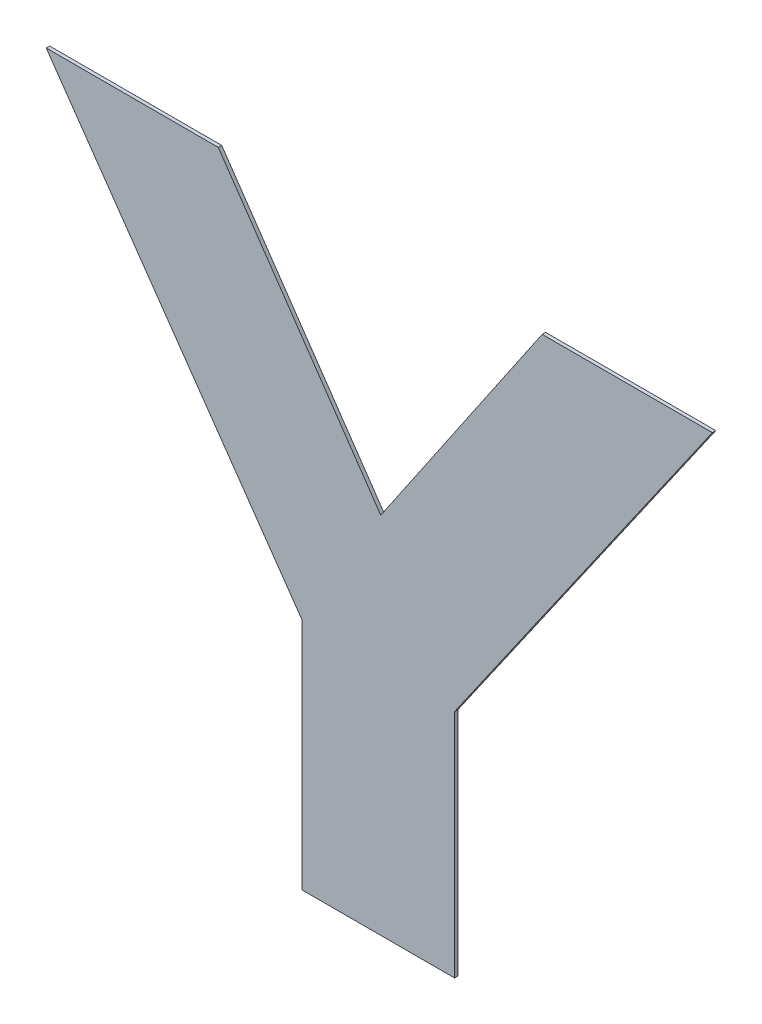
ISO-10303-21;
HEADER;
FILE_DESCRIPTION(('STEP AP214'),'2;1');
FILE_NAME('part.step','',(''),(''),'','','');
FILE_SCHEMA(('AUTOMOTIVE_DESIGN { 1 0 10303 214 1 1 1 1 }'));
ENDSEC;
DATA;
#1=APPLICATION_CONTEXT('core data for automotive mechanical design processes');
#2=APPLICATION_PROTOCOL_DEFINITION('international standard','automotive_design',2000,#1);
#3=PRODUCT_CONTEXT('',#1,'mechanical');
#4=PRODUCT('Part','Part','',(#3));
#5=PRODUCT_RELATED_PRODUCT_CATEGORY('part','',(#4));
#6=PRODUCT_DEFINITION_FORMATION('','',#4);
#7=PRODUCT_DEFINITION_CONTEXT('part definition',#1,'design');
#8=PRODUCT_DEFINITION('design','',#6,#7);
#9=PRODUCT_DEFINITION_SHAPE('','',#8);
#10=(LENGTH_UNIT() NAMED_UNIT(*) SI_UNIT(.MILLI.,.METRE.));
#11=(NAMED_UNIT(*) PLANE_ANGLE_UNIT() SI_UNIT($,.RADIAN.));
#12=(NAMED_UNIT(*) SI_UNIT($,.STERADIAN.) SOLID_ANGLE_UNIT());
#13=UNCERTAINTY_MEASURE_WITH_UNIT(LENGTH_MEASURE(1.E-05),#10,'distance_accuracy_value','');
#14=(GEOMETRIC_REPRESENTATION_CONTEXT(3) GLOBAL_UNCERTAINTY_ASSIGNED_CONTEXT((#13)) GLOBAL_UNIT_ASSIGNED_CONTEXT((#10,
#11,#12)) REPRESENTATION_CONTEXT('',''));
#15=CARTESIAN_POINT('',(0.,0.,0.));
#16=DIRECTION('',(0.,0.,1.));
#17=DIRECTION('',(1.,0.,0.));
#18=AXIS2_PLACEMENT_3D('',#15,#16,#17);
#19=CARTESIAN_POINT('',(0.00426733972599983,0.917937256962008,0.00015));
#20=DIRECTION('',(-0.820629637441726,-0.571460408210631,0.));
#21=DIRECTION('',(0.,0.,1.));
#22=AXIS2_PLACEMENT_3D('',#19,#20,#21);
#23=PLANE('',#22);
#24=DIRECTION('',(0.,0.,1.));
#25=VECTOR('',#24,1.);
#26=CARTESIAN_POINT('',(0.00985104395099982,0.909918935643667,0.));
#27=LINE('',#26,#25);
#28=CARTESIAN_POINT('',(0.00985104395099982,0.909918935643667,0.));
#29=VERTEX_POINT('',#28);
#30=CARTESIAN_POINT('',(0.00985104395099982,0.909918935643667,0.00015));
#31=VERTEX_POINT('',#30);
#32=EDGE_CURVE('E11',#29,#31,#27,.T.);
#33=ORIENTED_EDGE('',*,*,#32,.T.);
#34=DIRECTION('',(-0.571460408210631,0.820629637441726,0.));
#35=VECTOR('',#34,1.);
#36=CARTESIAN_POINT('',(0.00985104395099982,0.909918935643667,0.00015));
#37=LINE('',#36,#35);
#38=CARTESIAN_POINT('',(-0.00131636449900017,0.92595557828035,0.00015));
#39=VERTEX_POINT('',#38);
#40=EDGE_CURVE('E24',#31,#39,#37,.T.);
#41=ORIENTED_EDGE('',*,*,#40,.T.);
#42=DIRECTION('',(0.,0.,1.));
#43=VECTOR('',#42,1.);
#44=CARTESIAN_POINT('',(-0.00131636449900017,0.92595557828035,0.));
#45=LINE('',#44,#43);
#46=CARTESIAN_POINT('',(-0.00131636449900017,0.92595557828035,0.));
#47=VERTEX_POINT('',#46);
#48=EDGE_CURVE('E155',#47,#39,#45,.T.);
#49=ORIENTED_EDGE('',*,*,#48,.F.);
#50=DIRECTION('',(-0.571460408210631,0.820629637441726,0.));
#51=VECTOR('',#50,1.);
#52=CARTESIAN_POINT('',(0.00985104395099982,0.909918935643667,0.));
#53=LINE('',#52,#51);
#54=EDGE_CURVE('E153',#29,#47,#53,.T.);
#55=ORIENTED_EDGE('',*,*,#54,.F.);
#56=EDGE_LOOP('',(#33,#41,#49,#55));
#57=FACE_BOUND('',#56,.T.);
#58=ADVANCED_FACE('F17',(#57),#23,.T.);
#59=CARTESIAN_POINT('',(0.00244222272599983,0.92595557828035,0.00015));
#60=DIRECTION('',(0.,1.,0.));
#61=DIRECTION('',(0.,0.,1.));
#62=AXIS2_PLACEMENT_3D('',#59,#60,#61);
#63=PLANE('',#62);
#64=ORIENTED_EDGE('',*,*,#48,.T.);
#65=DIRECTION('',(1.,0.,0.));
#66=VECTOR('',#65,1.);
#67=CARTESIAN_POINT('',(-0.00131636449900017,0.92595557828035,0.00015));
#68=LINE('',#67,#66);
#69=CARTESIAN_POINT('',(0.00620080995099983,0.92595557828035,0.00015));
#70=VERTEX_POINT('',#69);
#71=EDGE_CURVE('E151',#39,#70,#68,.T.);
#72=ORIENTED_EDGE('',*,*,#71,.T.);
#73=DIRECTION('',(0.,0.,1.));
#74=VECTOR('',#73,1.);
#75=CARTESIAN_POINT('',(0.00620080995099983,0.92595557828035,0.));
#76=LINE('',#75,#74);
#77=CARTESIAN_POINT('',(0.00620080995099983,0.92595557828035,0.));
#78=VERTEX_POINT('',#77);
#79=EDGE_CURVE('E148',#78,#70,#76,.T.);
#80=ORIENTED_EDGE('',*,*,#79,.F.);
#81=DIRECTION('',(1.,0.,0.));
#82=VECTOR('',#81,1.);
#83=CARTESIAN_POINT('',(-0.00131636449900017,0.92595557828035,0.));
#84=LINE('',#83,#82);
#85=EDGE_CURVE('E145',#47,#78,#84,.T.);
#86=ORIENTED_EDGE('',*,*,#85,.F.);
#87=EDGE_LOOP('',(#64,#72,#80,#86));
#88=FACE_BOUND('',#87,.T.);
#89=ADVANCED_FACE('F161',(#88),#63,.T.);
#90=CARTESIAN_POINT('',(0.00974945876767483,0.920771435634508,0.00015));
#91=DIRECTION('',(0.8251882666148,0.564857791520363,0.));
#92=DIRECTION('',(0.,0.,-1.));
#93=AXIS2_PLACEMENT_3D('',#90,#91,#92);
#94=PLANE('',#93);
#95=ORIENTED_EDGE('',*,*,#79,.T.);
#96=DIRECTION('',(0.564857791520363,-0.8251882666148,0.));
#97=VECTOR('',#96,1.);
#98=CARTESIAN_POINT('',(0.00620080995099983,0.92595557828035,0.00015));
#99=LINE('',#98,#97);
#100=CARTESIAN_POINT('',(0.0132981075843498,0.915587292988667,0.00015));
#101=VERTEX_POINT('',#100);
#102=EDGE_CURVE('E143',#70,#101,#99,.T.);
#103=ORIENTED_EDGE('',*,*,#102,.T.);
#104=DIRECTION('',(0.,0.,1.));
#105=VECTOR('',#104,1.);
#106=CARTESIAN_POINT('',(0.0132981075843498,0.915587292988667,0.));
#107=LINE('',#106,#105);
#108=CARTESIAN_POINT('',(0.0132981075843498,0.915587292988667,0.));
#109=VERTEX_POINT('',#108);
#110=EDGE_CURVE('E140',#109,#101,#107,.T.);
#111=ORIENTED_EDGE('',*,*,#110,.F.);
#112=DIRECTION('',(0.564857791520363,-0.8251882666148,0.));
#113=VECTOR('',#112,1.);
#114=CARTESIAN_POINT('',(0.00620080995099983,0.92595557828035,0.));
#115=LINE('',#114,#113);
#116=EDGE_CURVE('E137',#78,#109,#115,.T.);
#117=ORIENTED_EDGE('',*,*,#116,.F.);
#118=EDGE_LOOP('',(#95,#103,#111,#117));
#119=FACE_BOUND('',#118,.T.);
#120=ADVANCED_FACE('F167',(#119),#94,.T.);
#121=CARTESIAN_POINT('',(0.0168230539676748,0.920771435634508,0.00015));
#122=DIRECTION('',(-0.826946573811709,0.562280503006352,0.));
#123=DIRECTION('',(0.,0.,1.));
#124=AXIS2_PLACEMENT_3D('',#121,#122,#123);
#125=PLANE('',#124);
#126=ORIENTED_EDGE('',*,*,#110,.T.);
#127=DIRECTION('',(0.562280503006352,0.826946573811709,0.));
#128=VECTOR('',#127,1.);
#129=CARTESIAN_POINT('',(0.0132981075843498,0.915587292988667,0.00015));
#130=LINE('',#129,#128);
#131=CARTESIAN_POINT('',(0.0203480003509998,0.92595557828035,0.00015));
#132=VERTEX_POINT('',#131);
#133=EDGE_CURVE('E135',#101,#132,#130,.T.);
#134=ORIENTED_EDGE('',*,*,#133,.T.);
#135=DIRECTION('',(0.,0.,1.));
#136=VECTOR('',#135,1.);
#137=CARTESIAN_POINT('',(0.0203480003509998,0.92595557828035,0.));
#138=LINE('',#137,#136);
#139=CARTESIAN_POINT('',(0.0203480003509998,0.92595557828035,0.));
#140=VERTEX_POINT('',#139);
#141=EDGE_CURVE('E132',#140,#132,#138,.T.);
#142=ORIENTED_EDGE('',*,*,#141,.F.);
#143=DIRECTION('',(0.562280503006352,0.826946573811709,0.));
#144=VECTOR('',#143,1.);
#145=CARTESIAN_POINT('',(0.0132981075843498,0.915587292988667,0.));
#146=LINE('',#145,#144);
#147=EDGE_CURVE('E129',#109,#140,#146,.T.);
#148=ORIENTED_EDGE('',*,*,#147,.F.);
#149=EDGE_LOOP('',(#126,#134,#142,#148));
#150=FACE_BOUND('',#149,.T.);
#151=ADVANCED_FACE('F171',(#150),#125,.T.);
#152=CARTESIAN_POINT('',(0.0240659549843248,0.92595557828035,0.00015));
#153=DIRECTION('',(0.,1.,0.));
#154=DIRECTION('',(0.,0.,1.));
#155=AXIS2_PLACEMENT_3D('',#152,#153,#154);
#156=PLANE('',#155);
#157=ORIENTED_EDGE('',*,*,#141,.T.);
#158=DIRECTION('',(1.,0.,0.));
#159=VECTOR('',#158,1.);
#160=CARTESIAN_POINT('',(0.0203480003509998,0.92595557828035,0.00015));
#161=LINE('',#160,#159);
#162=CARTESIAN_POINT('',(0.0277839096176498,0.92595557828035,0.00015));
#163=VERTEX_POINT('',#162);
#164=EDGE_CURVE('E127',#132,#163,#161,.T.);
#165=ORIENTED_EDGE('',*,*,#164,.T.);
#166=DIRECTION('',(0.,0.,1.));
#167=VECTOR('',#166,1.);
#168=CARTESIAN_POINT('',(0.0277839096176498,0.92595557828035,0.));
#169=LINE('',#168,#167);
#170=CARTESIAN_POINT('',(0.0277839096176498,0.92595557828035,0.));
#171=VERTEX_POINT('',#170);
#172=EDGE_CURVE('E124',#171,#163,#169,.T.);
#173=ORIENTED_EDGE('',*,*,#172,.F.);
#174=DIRECTION('',(1.,0.,0.));
#175=VECTOR('',#174,1.);
#176=CARTESIAN_POINT('',(0.0203480003509998,0.92595557828035,0.));
#177=LINE('',#176,#175);
#178=EDGE_CURVE('E121',#140,#171,#177,.T.);
#179=ORIENTED_EDGE('',*,*,#178,.F.);
#180=EDGE_LOOP('',(#157,#165,#173,#179));
#181=FACE_BOUND('',#180,.T.);
#182=ADVANCED_FACE('F175',(#181),#156,.T.);
#183=CARTESIAN_POINT('',(0.0221527994676498,0.917862762466175,0.00015));
#184=DIRECTION('',(0.82084218361782,-0.571155066154131,0.));
#185=DIRECTION('',(0.,0.,-1.));
#186=AXIS2_PLACEMENT_3D('',#183,#184,#185);
#187=PLANE('',#186);
#188=ORIENTED_EDGE('',*,*,#172,.T.);
#189=DIRECTION('',(-0.571155066154131,-0.82084218361782,0.));
#190=VECTOR('',#189,1.);
#191=CARTESIAN_POINT('',(0.0277839096176498,0.92595557828035,0.00015));
#192=LINE('',#191,#190);
#193=CARTESIAN_POINT('',(0.0165216893176498,0.909769946652,0.00015));
#194=VERTEX_POINT('',#193);
#195=EDGE_CURVE('E119',#163,#194,#192,.T.);
#196=ORIENTED_EDGE('',*,*,#195,.T.);
#197=DIRECTION('',(0.,0.,1.));
#198=VECTOR('',#197,1.);
#199=CARTESIAN_POINT('',(0.0165216893176498,0.909769946652,0.));
#200=LINE('',#199,#198);
#201=CARTESIAN_POINT('',(0.0165216893176498,0.909769946652,0.));
#202=VERTEX_POINT('',#201);
#203=EDGE_CURVE('E116',#202,#194,#200,.T.);
#204=ORIENTED_EDGE('',*,*,#203,.F.);
#205=DIRECTION('',(-0.571155066154131,-0.82084218361782,0.));
#206=VECTOR('',#205,1.);
#207=CARTESIAN_POINT('',(0.0277839096176498,0.92595557828035,0.));
#208=LINE('',#207,#206);
#209=EDGE_CURVE('E114',#171,#202,#208,.T.);
#210=ORIENTED_EDGE('',*,*,#209,.F.);
#211=EDGE_LOOP('',(#188,#196,#204,#210));
#212=FACE_BOUND('',#211,.T.);
#213=ADVANCED_FACE('F178',(#212),#187,.T.);
#214=CARTESIAN_POINT('',(0.0165216893176498,0.904731068405325,0.00015));
#215=DIRECTION('',(1.,0.,0.));
#216=DIRECTION('',(0.,0.,-1.));
#217=AXIS2_PLACEMENT_3D('',#214,#215,#216);
#218=PLANE('',#217);
#219=ORIENTED_EDGE('',*,*,#203,.T.);
#220=DIRECTION('',(0.,-1.,0.));
#221=VECTOR('',#220,1.);
#222=CARTESIAN_POINT('',(0.0165216893176498,0.909769946652,0.00015));
#223=LINE('',#222,#221);
#224=CARTESIAN_POINT('',(0.0165216893176498,0.89969219015865,0.00015));
#225=VERTEX_POINT('',#224);
#226=EDGE_CURVE('E112',#194,#225,#223,.T.);
#227=ORIENTED_EDGE('',*,*,#226,.T.);
#228=DIRECTION('',(0.,0.,1.));
#229=VECTOR('',#228,1.);
#230=CARTESIAN_POINT('',(0.0165216893176498,0.89969219015865,0.));
#231=LINE('',#230,#229);
#232=CARTESIAN_POINT('',(0.0165216893176498,0.89969219015865,0.));
#233=VERTEX_POINT('',#232);
#234=EDGE_CURVE('E110',#233,#225,#231,.T.);
#235=ORIENTED_EDGE('',*,*,#234,.F.);
#236=DIRECTION('',(0.,-1.,0.));
#237=VECTOR('',#236,1.);
#238=CARTESIAN_POINT('',(0.0165216893176498,0.909769946652,0.));
#239=LINE('',#238,#237);
#240=EDGE_CURVE('E101',#202,#233,#239,.T.);
#241=ORIENTED_EDGE('',*,*,#240,.F.);
#242=EDGE_LOOP('',(#219,#227,#235,#241));
#243=FACE_BOUND('',#242,.T.);
#244=ADVANCED_FACE('F181',(#243),#218,.T.);
#245=CARTESIAN_POINT('',(0.0131863666343248,0.89969219015865,0.00015));
#246=DIRECTION('',(0.,-1.,0.));
#247=DIRECTION('',(0.,0.,-1.));
#248=AXIS2_PLACEMENT_3D('',#245,#246,#247);
#249=PLANE('',#248);
#250=ORIENTED_EDGE('',*,*,#234,.T.);
#251=DIRECTION('',(-1.,0.,0.));
#252=VECTOR('',#251,1.);
#253=CARTESIAN_POINT('',(0.0165216893176498,0.89969219015865,0.00015));
#254=LINE('',#253,#252);
#255=CARTESIAN_POINT('',(0.00985104395099982,0.89969219015865,0.00015));
#256=VERTEX_POINT('',#255);
#257=EDGE_CURVE('E90',#225,#256,#254,.T.);
#258=ORIENTED_EDGE('',*,*,#257,.T.);
#259=DIRECTION('',(0.,0.,1.));
#260=VECTOR('',#259,1.);
#261=CARTESIAN_POINT('',(0.00985104395099982,0.89969219015865,0.));
#262=LINE('',#261,#260);
#263=CARTESIAN_POINT('',(0.00985104395099982,0.89969219015865,0.));
#264=VERTEX_POINT('',#263);
#265=EDGE_CURVE('E84',#264,#256,#262,.T.);
#266=ORIENTED_EDGE('',*,*,#265,.F.);
#267=DIRECTION('',(-1.,0.,0.));
#268=VECTOR('',#267,1.);
#269=CARTESIAN_POINT('',(0.0165216893176498,0.89969219015865,0.));
#270=LINE('',#269,#268);
#271=EDGE_CURVE('E88',#233,#264,#270,.T.);
#272=ORIENTED_EDGE('',*,*,#271,.F.);
#273=EDGE_LOOP('',(#250,#258,#266,#272));
#274=FACE_BOUND('',#273,.T.);
#275=ADVANCED_FACE('F87',(#274),#249,.T.);
#276=CARTESIAN_POINT('',(0.00985104395099982,0.904805562901159,0.00015));
#277=DIRECTION('',(-1.,0.,0.));
#278=DIRECTION('',(0.,0.,1.));
#279=AXIS2_PLACEMENT_3D('',#276,#277,#278);
#280=PLANE('',#279);
#281=ORIENTED_EDGE('',*,*,#265,.T.);
#282=DIRECTION('',(0.,1.,0.));
#283=VECTOR('',#282,1.);
#284=CARTESIAN_POINT('',(0.00985104395099982,0.89969219015865,0.00015));
#285=LINE('',#284,#283);
#286=EDGE_CURVE('E102',#256,#31,#285,.T.);
#287=ORIENTED_EDGE('',*,*,#286,.T.);
#288=ORIENTED_EDGE('',*,*,#32,.F.);
#289=DIRECTION('',(0.,1.,0.));
#290=VECTOR('',#289,1.);
#291=CARTESIAN_POINT('',(0.00985104395099982,0.89969219015865,0.));
#292=LINE('',#291,#290);
#293=EDGE_CURVE('E98',#264,#29,#292,.T.);
#294=ORIENTED_EDGE('',*,*,#293,.F.);
#295=EDGE_LOOP('',(#281,#287,#288,#294));
#296=FACE_BOUND('',#295,.T.);
#297=ADVANCED_FACE('F104',(#296),#280,.T.);
#298=CARTESIAN_POINT('',(0.0132337725593248,0.89969219015865,0.));
#299=DIRECTION('',(0.,0.,1.));
#300=DIRECTION('',(1.,0.,0.));
#301=AXIS2_PLACEMENT_3D('',#298,#299,#300);
#302=PLANE('',#301);
#303=ORIENTED_EDGE('',*,*,#54,.T.);
#304=ORIENTED_EDGE('',*,*,#85,.T.);
#305=ORIENTED_EDGE('',*,*,#116,.T.);
#306=ORIENTED_EDGE('',*,*,#147,.T.);
#307=ORIENTED_EDGE('',*,*,#178,.T.);
#308=ORIENTED_EDGE('',*,*,#209,.T.);
#309=ORIENTED_EDGE('',*,*,#240,.T.);
#310=ORIENTED_EDGE('',*,*,#271,.T.);
#311=ORIENTED_EDGE('',*,*,#293,.T.);
#312=EDGE_LOOP('',(#303,#304,#305,#306,#307,#308,#309,#310,#311));
#313=FACE_BOUND('',#312,.T.);
#314=ADVANCED_FACE('F97',(#313),#302,.F.);
#315=CARTESIAN_POINT('',(0.0132337725593248,0.89969219015865,0.00015));
#316=DIRECTION('',(0.,0.,1.));
#317=DIRECTION('',(1.,0.,0.));
#318=AXIS2_PLACEMENT_3D('',#315,#316,#317);
#319=PLANE('',#318);
#320=ORIENTED_EDGE('',*,*,#40,.F.);
#321=ORIENTED_EDGE('',*,*,#286,.F.);
#322=ORIENTED_EDGE('',*,*,#257,.F.);
#323=ORIENTED_EDGE('',*,*,#226,.F.);
#324=ORIENTED_EDGE('',*,*,#195,.F.);
#325=ORIENTED_EDGE('',*,*,#164,.F.);
#326=ORIENTED_EDGE('',*,*,#133,.F.);
#327=ORIENTED_EDGE('',*,*,#102,.F.);
#328=ORIENTED_EDGE('',*,*,#71,.F.);
#329=EDGE_LOOP('',(#320,#321,#322,#323,#324,#325,#326,#327,#328));
#330=FACE_BOUND('',#329,.T.);
#331=ADVANCED_FACE('F163',(#330),#319,.T.);
#332=CLOSED_SHELL('',(#58,#89,#120,#151,#182,#213,#244,#275,#297,#314,#331));
#333=MANIFOLD_SOLID_BREP('B1',#332);
#334=ADVANCED_BREP_SHAPE_REPRESENTATION('',(#18,#333),#14);
#335=SHAPE_DEFINITION_REPRESENTATION(#9,#334);
ENDSEC;
END-ISO-10303-21;
